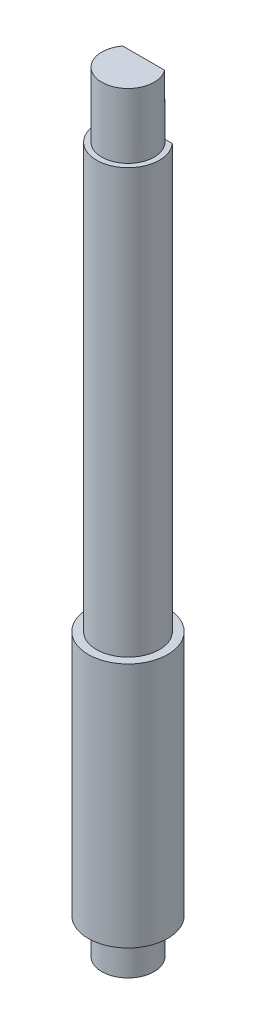
ISO-10303-21;
HEADER;
FILE_DESCRIPTION(('STEP AP214'),'2;1');
FILE_NAME('part.step','',(''),(''),'','','');
FILE_SCHEMA(('AUTOMOTIVE_DESIGN { 1 0 10303 214 1 1 1 1 }'));
ENDSEC;
DATA;
#1=APPLICATION_CONTEXT('core data for automotive mechanical design processes');
#2=APPLICATION_PROTOCOL_DEFINITION('international standard','automotive_design',2000,#1);
#3=PRODUCT_CONTEXT('',#1,'mechanical');
#4=PRODUCT('Part','Part','',(#3));
#5=PRODUCT_RELATED_PRODUCT_CATEGORY('part','',(#4));
#6=PRODUCT_DEFINITION_FORMATION('','',#4);
#7=PRODUCT_DEFINITION_CONTEXT('part definition',#1,'design');
#8=PRODUCT_DEFINITION('design','',#6,#7);
#9=PRODUCT_DEFINITION_SHAPE('','',#8);
#10=(LENGTH_UNIT() NAMED_UNIT(*) SI_UNIT(.MILLI.,.METRE.));
#11=(NAMED_UNIT(*) PLANE_ANGLE_UNIT() SI_UNIT($,.RADIAN.));
#12=(NAMED_UNIT(*) SI_UNIT($,.STERADIAN.) SOLID_ANGLE_UNIT());
#13=UNCERTAINTY_MEASURE_WITH_UNIT(LENGTH_MEASURE(1.E-05),#10,'distance_accuracy_value','');
#14=(GEOMETRIC_REPRESENTATION_CONTEXT(3) GLOBAL_UNCERTAINTY_ASSIGNED_CONTEXT((#13)) GLOBAL_UNIT_ASSIGNED_CONTEXT((#10,
#11,#12)) REPRESENTATION_CONTEXT('',''));
#15=CARTESIAN_POINT('',(0.,0.,0.));
#16=DIRECTION('',(0.,0.,1.));
#17=DIRECTION('',(1.,0.,0.));
#18=AXIS2_PLACEMENT_3D('',#15,#16,#17);
#19=CARTESIAN_POINT('',(-1.11803398874989,-19.6868180292782,-1.));
#20=DIRECTION('',(0.,0.,1.));
#21=DIRECTION('',(1.,0.,0.));
#22=AXIS2_PLACEMENT_3D('',#19,#20,#21);
#23=PLANE('',#22);
#24=DIRECTION('',(-1.,0.,0.));
#25=VECTOR('',#24,1.);
#26=CARTESIAN_POINT('',(-1.1180339887499,4.55446981819967,-1.));
#27=LINE('',#26,#25);
#28=CARTESIAN_POINT('',(0.75,4.55446981819967,-1.));
#29=VERTEX_POINT('',#28);
#30=CARTESIAN_POINT('',(-0.75,4.55446981819967,-1.));
#31=VERTEX_POINT('',#30);
#32=EDGE_CURVE('E11',#29,#31,#27,.T.);
#33=ORIENTED_EDGE('',*,*,#32,.F.);
#34=DIRECTION('',(0.,1.,0.));
#35=VECTOR('',#34,1.);
#36=CARTESIAN_POINT('',(0.75,5.95446981819967,-1.));
#37=LINE('',#36,#35);
#38=CARTESIAN_POINT('',(0.75,2.85446981819967,-1.));
#39=VERTEX_POINT('',#38);
#40=EDGE_CURVE('E57',#29,#39,#37,.F.);
#41=ORIENTED_EDGE('',*,*,#40,.T.);
#42=DIRECTION('',(-1.,0.,0.));
#43=VECTOR('',#42,1.);
#44=CARTESIAN_POINT('',(0.,2.85446981819967,-1.));
#45=LINE('',#44,#43);
#46=CARTESIAN_POINT('',(1.11803398874989,2.85446981819967,-1.));
#47=VERTEX_POINT('',#46);
#48=EDGE_CURVE('E124',#47,#39,#45,.T.);
#49=ORIENTED_EDGE('',*,*,#48,.F.);
#50=DIRECTION('',(0.,1.,0.));
#51=VECTOR('',#50,1.);
#52=CARTESIAN_POINT('',(1.1180339887499,-19.6868180292782,-1.));
#53=LINE('',#52,#51);
#54=CARTESIAN_POINT('',(1.1180339887499,-17.3955301818003,-1.));
#55=VERTEX_POINT('',#54);
#56=EDGE_CURVE('E113',#55,#47,#53,.T.);
#57=ORIENTED_EDGE('',*,*,#56,.F.);
#58=DIRECTION('',(-1.,0.,0.));
#59=VECTOR('',#58,1.);
#60=CARTESIAN_POINT('',(-1.11803398874989,-17.3955301818003,-1.));
#61=LINE('',#60,#59);
#62=CARTESIAN_POINT('',(-1.1180339887499,-17.3955301818003,-1.));
#63=VERTEX_POINT('',#62);
#64=EDGE_CURVE('E116',#55,#63,#61,.T.);
#65=ORIENTED_EDGE('',*,*,#64,.T.);
#66=DIRECTION('',(0.,1.,0.));
#67=VECTOR('',#66,1.);
#68=CARTESIAN_POINT('',(-1.11803398874989,-19.6868180292782,-1.));
#69=LINE('',#68,#67);
#70=CARTESIAN_POINT('',(-1.1180339887499,2.85446981819967,-1.));
#71=VERTEX_POINT('',#70);
#72=EDGE_CURVE('E109',#63,#71,#69,.T.);
#73=ORIENTED_EDGE('',*,*,#72,.T.);
#74=CARTESIAN_POINT('',(-0.75,2.85446981819967,-1.));
#75=VERTEX_POINT('',#74);
#76=EDGE_CURVE('E121',#75,#71,#45,.T.);
#77=ORIENTED_EDGE('',*,*,#76,.F.);
#78=DIRECTION('',(0.,1.,0.));
#79=VECTOR('',#78,1.);
#80=CARTESIAN_POINT('',(-0.75,5.95446981819967,-1.));
#81=LINE('',#80,#79);
#82=EDGE_CURVE('E119',#75,#31,#81,.T.);
#83=ORIENTED_EDGE('',*,*,#82,.T.);
#84=EDGE_LOOP('',(#33,#41,#49,#57,#65,#73,#77,#83));
#85=FACE_BOUND('',#84,.T.);
#86=ADVANCED_FACE('F36',(#85),#23,.F.);
#87=CARTESIAN_POINT('',(0.,5.95446981819967,0.));
#88=DIRECTION('',(0.,1.,0.));
#89=DIRECTION('',(-1.,0.,0.));
#90=AXIS2_PLACEMENT_3D('',#87,#88,#89);
#91=CYLINDRICAL_SURFACE('',#90,1.25);
#92=CARTESIAN_POINT('',(0.,-30.8455301818003,0.));
#93=DIRECTION('',(0.,1.,0.));
#94=DIRECTION('',(-1.,0.,0.));
#95=AXIS2_PLACEMENT_3D('',#92,#93,#94);
#96=CIRCLE('',#95,1.25);
#97=CARTESIAN_POINT('',(-1.25,-30.8455301818003,0.));
#98=VERTEX_POINT('',#97);
#99=EDGE_CURVE('E126',#98,#98,#96,.T.);
#100=ORIENTED_EDGE('',*,*,#99,.T.);
#101=EDGE_LOOP('',(#100));
#102=FACE_BOUND('',#101,.T.);
#103=CARTESIAN_POINT('',(0.,-29.1455301818003,0.));
#104=DIRECTION('',(0.,1.,0.));
#105=DIRECTION('',(-1.,0.,0.));
#106=AXIS2_PLACEMENT_3D('',#103,#104,#105);
#107=CIRCLE('',#106,1.25);
#108=CARTESIAN_POINT('',(-1.25,-29.1455301818003,0.));
#109=VERTEX_POINT('',#108);
#110=EDGE_CURVE('E44',#109,#109,#107,.T.);
#111=ORIENTED_EDGE('',*,*,#110,.F.);
#112=EDGE_LOOP('',(#111));
#113=FACE_BOUND('',#112,.T.);
#114=ADVANCED_FACE('F38',(#102,#113),#91,.T.);
#115=CARTESIAN_POINT('',(0.,-29.1455301818003,0.));
#116=DIRECTION('',(0.,-1.,0.));
#117=DIRECTION('',(1.,0.,0.));
#118=AXIS2_PLACEMENT_3D('',#115,#116,#117);
#119=PLANE('',#118);
#120=ORIENTED_EDGE('',*,*,#110,.T.);
#121=EDGE_LOOP('',(#120));
#122=FACE_BOUND('',#121,.T.);
#123=CARTESIAN_POINT('',(0.,-29.1455301818003,0.));
#124=DIRECTION('',(0.,1.,0.));
#125=DIRECTION('',(-1.,0.,0.));
#126=AXIS2_PLACEMENT_3D('',#123,#124,#125);
#127=CIRCLE('',#126,1.9);
#128=CARTESIAN_POINT('',(-1.9,-29.1455301818003,0.));
#129=VERTEX_POINT('',#128);
#130=EDGE_CURVE('E142',#129,#129,#127,.T.);
#131=ORIENTED_EDGE('',*,*,#130,.F.);
#132=EDGE_LOOP('',(#131));
#133=FACE_BOUND('',#132,.T.);
#134=ADVANCED_FACE('F147',(#122,#133),#119,.T.);
#135=CARTESIAN_POINT('',(0.,5.95446981819967,0.));
#136=DIRECTION('',(0.,1.,0.));
#137=DIRECTION('',(-1.,0.,0.));
#138=AXIS2_PLACEMENT_3D('',#135,#136,#137);
#139=CYLINDRICAL_SURFACE('',#138,1.9);
#140=ORIENTED_EDGE('',*,*,#130,.T.);
#141=EDGE_LOOP('',(#140));
#142=FACE_BOUND('',#141,.T.);
#143=CARTESIAN_POINT('',(0.,-17.3955301818003,0.));
#144=DIRECTION('',(0.,1.,0.));
#145=DIRECTION('',(-1.,0.,0.));
#146=AXIS2_PLACEMENT_3D('',#143,#144,#145);
#147=CIRCLE('',#146,1.9);
#148=CARTESIAN_POINT('',(-1.9,-17.3955301818003,0.));
#149=VERTEX_POINT('',#148);
#150=EDGE_CURVE('E139',#149,#149,#147,.T.);
#151=ORIENTED_EDGE('',*,*,#150,.F.);
#152=EDGE_LOOP('',(#151));
#153=FACE_BOUND('',#152,.T.);
#154=ADVANCED_FACE('F156',(#142,#153),#139,.T.);
#155=CARTESIAN_POINT('',(0.,-17.3955301818003,0.));
#156=DIRECTION('',(0.,1.,0.));
#157=DIRECTION('',(-1.,0.,0.));
#158=AXIS2_PLACEMENT_3D('',#155,#156,#157);
#159=PLANE('',#158);
#160=ORIENTED_EDGE('',*,*,#150,.T.);
#161=EDGE_LOOP('',(#160));
#162=FACE_BOUND('',#161,.T.);
#163=CARTESIAN_POINT('',(0.,-17.3955301818003,0.));
#164=DIRECTION('',(0.,1.,0.));
#165=DIRECTION('',(-1.,0.,0.));
#166=AXIS2_PLACEMENT_3D('',#163,#164,#165);
#167=CIRCLE('',#166,1.5);
#168=EDGE_CURVE('E136',#63,#55,#167,.T.);
#169=ORIENTED_EDGE('',*,*,#168,.F.);
#170=ORIENTED_EDGE('',*,*,#64,.F.);
#171=EDGE_LOOP('',(#169,#170));
#172=FACE_BOUND('',#171,.T.);
#173=ADVANCED_FACE('F182',(#162,#172),#159,.T.);
#174=CARTESIAN_POINT('',(0.,5.95446981819967,0.));
#175=DIRECTION('',(0.,1.,0.));
#176=DIRECTION('',(-1.,0.,0.));
#177=AXIS2_PLACEMENT_3D('',#174,#175,#176);
#178=CYLINDRICAL_SURFACE('',#177,1.5);
#179=ORIENTED_EDGE('',*,*,#56,.T.);
#180=CARTESIAN_POINT('',(0.,2.85446981819967,0.));
#181=DIRECTION('',(0.,1.,0.));
#182=DIRECTION('',(-1.,0.,0.));
#183=AXIS2_PLACEMENT_3D('',#180,#181,#182);
#184=CIRCLE('',#183,1.5);
#185=EDGE_CURVE('E133',#71,#47,#184,.T.);
#186=ORIENTED_EDGE('',*,*,#185,.F.);
#187=ORIENTED_EDGE('',*,*,#72,.F.);
#188=ORIENTED_EDGE('',*,*,#168,.T.);
#189=EDGE_LOOP('',(#179,#186,#187,#188));
#190=FACE_BOUND('',#189,.T.);
#191=ADVANCED_FACE('F178',(#190),#178,.T.);
#192=CARTESIAN_POINT('',(0.,2.85446981819967,0.));
#193=DIRECTION('',(0.,-1.,0.));
#194=DIRECTION('',(1.,0.,0.));
#195=AXIS2_PLACEMENT_3D('',#192,#193,#194);
#196=PLANE('',#195);
#197=ORIENTED_EDGE('',*,*,#185,.T.);
#198=ORIENTED_EDGE('',*,*,#48,.T.);
#199=CARTESIAN_POINT('',(0.,2.85446981819967,0.));
#200=DIRECTION('',(0.,1.,0.));
#201=DIRECTION('',(-1.,0.,0.));
#202=AXIS2_PLACEMENT_3D('',#199,#200,#201);
#203=CIRCLE('',#202,1.25);
#204=EDGE_CURVE('E130',#75,#39,#203,.T.);
#205=ORIENTED_EDGE('',*,*,#204,.F.);
#206=ORIENTED_EDGE('',*,*,#76,.T.);
#207=EDGE_LOOP('',(#197,#198,#205,#206));
#208=FACE_BOUND('',#207,.T.);
#209=ADVANCED_FACE('F175',(#208),#196,.F.);
#210=CARTESIAN_POINT('',(0.,5.95446981819967,0.));
#211=DIRECTION('',(0.,1.,0.));
#212=DIRECTION('',(-1.,0.,0.));
#213=AXIS2_PLACEMENT_3D('',#210,#211,#212);
#214=CYLINDRICAL_SURFACE('',#213,1.25);
#215=DIRECTION('',(0.,1.,0.));
#216=VECTOR('',#215,1.);
#217=CARTESIAN_POINT('',(-1.,4.55446981819967,-0.75));
#218=LINE('',#217,#216);
#219=CARTESIAN_POINT('',(-1.,4.55446981819967,-0.75));
#220=VERTEX_POINT('',#219);
#221=CARTESIAN_POINT('',(-1.,5.95446981819967,-0.75));
#222=VERTEX_POINT('',#221);
#223=EDGE_CURVE('E99',#220,#222,#218,.T.);
#224=ORIENTED_EDGE('',*,*,#223,.F.);
#225=CARTESIAN_POINT('',(0.,4.55446981819967,0.));
#226=DIRECTION('',(0.,1.,0.));
#227=DIRECTION('',(-1.,0.,0.));
#228=AXIS2_PLACEMENT_3D('',#225,#226,#227);
#229=CIRCLE('',#228,1.25);
#230=EDGE_CURVE('E87',#31,#220,#229,.T.);
#231=ORIENTED_EDGE('',*,*,#230,.F.);
#232=ORIENTED_EDGE('',*,*,#82,.F.);
#233=ORIENTED_EDGE('',*,*,#204,.T.);
#234=ORIENTED_EDGE('',*,*,#40,.F.);
#235=CARTESIAN_POINT('',(1.,4.55446981819967,-0.75));
#236=VERTEX_POINT('',#235);
#237=EDGE_CURVE('E50',#236,#29,#229,.T.);
#238=ORIENTED_EDGE('',*,*,#237,.F.);
#239=DIRECTION('',(0.,1.,0.));
#240=VECTOR('',#239,1.);
#241=CARTESIAN_POINT('',(1.,4.55446981819967,-0.75));
#242=LINE('',#241,#240);
#243=CARTESIAN_POINT('',(1.,5.95446981819967,-0.75));
#244=VERTEX_POINT('',#243);
#245=EDGE_CURVE('E102',#236,#244,#242,.T.);
#246=ORIENTED_EDGE('',*,*,#245,.T.);
#247=CARTESIAN_POINT('',(0.,5.95446981819967,0.));
#248=DIRECTION('',(0.,1.,0.));
#249=DIRECTION('',(-1.,0.,0.));
#250=AXIS2_PLACEMENT_3D('',#247,#248,#249);
#251=CIRCLE('',#250,1.25);
#252=EDGE_CURVE('E107',#222,#244,#251,.T.);
#253=ORIENTED_EDGE('',*,*,#252,.F.);
#254=EDGE_LOOP('',(#224,#231,#232,#233,#234,#238,#246,#253));
#255=FACE_BOUND('',#254,.T.);
#256=ADVANCED_FACE('F105',(#255),#214,.T.);
#257=CARTESIAN_POINT('',(0.,5.95446981819967,0.));
#258=DIRECTION('',(0.,-1.,0.));
#259=DIRECTION('',(1.,0.,0.));
#260=AXIS2_PLACEMENT_3D('',#257,#258,#259);
#261=PLANE('',#260);
#262=ORIENTED_EDGE('',*,*,#252,.T.);
#263=DIRECTION('',(1.,0.,0.));
#264=VECTOR('',#263,1.);
#265=CARTESIAN_POINT('',(-1.,5.95446981819967,-0.75));
#266=LINE('',#265,#264);
#267=EDGE_CURVE('E95',#222,#244,#266,.T.);
#268=ORIENTED_EDGE('',*,*,#267,.F.);
#269=EDGE_LOOP('',(#262,#268));
#270=FACE_BOUND('',#269,.T.);
#271=ADVANCED_FACE('F162',(#270),#261,.F.);
#272=CARTESIAN_POINT('',(0.,-30.8455301818003,0.));
#273=DIRECTION('',(0.,-1.,0.));
#274=DIRECTION('',(1.,0.,0.));
#275=AXIS2_PLACEMENT_3D('',#272,#273,#274);
#276=PLANE('',#275);
#277=ORIENTED_EDGE('',*,*,#99,.F.);
#278=EDGE_LOOP('',(#277));
#279=FACE_BOUND('',#278,.T.);
#280=ADVANCED_FACE('F160',(#279),#276,.T.);
#281=CARTESIAN_POINT('',(0.,4.55446981819967,0.));
#282=DIRECTION('',(0.,1.,0.));
#283=DIRECTION('',(-1.,0.,0.));
#284=AXIS2_PLACEMENT_3D('',#281,#282,#283);
#285=PLANE('',#284);
#286=ORIENTED_EDGE('',*,*,#32,.T.);
#287=ORIENTED_EDGE('',*,*,#230,.T.);
#288=DIRECTION('',(1.,0.,0.));
#289=VECTOR('',#288,1.);
#290=CARTESIAN_POINT('',(-1.,4.55446981819967,-0.75));
#291=LINE('',#290,#289);
#292=EDGE_CURVE('E90',#220,#236,#291,.T.);
#293=ORIENTED_EDGE('',*,*,#292,.T.);
#294=ORIENTED_EDGE('',*,*,#237,.T.);
#295=EDGE_LOOP('',(#286,#287,#293,#294));
#296=FACE_BOUND('',#295,.T.);
#297=ADVANCED_FACE('F89',(#296),#285,.T.);
#298=CARTESIAN_POINT('',(-1.,4.55446981819967,-0.75));
#299=DIRECTION('',(0.,0.,1.));
#300=DIRECTION('',(1.,0.,0.));
#301=AXIS2_PLACEMENT_3D('',#298,#299,#300);
#302=PLANE('',#301);
#303=ORIENTED_EDGE('',*,*,#267,.T.);
#304=ORIENTED_EDGE('',*,*,#245,.F.);
#305=ORIENTED_EDGE('',*,*,#292,.F.);
#306=ORIENTED_EDGE('',*,*,#223,.T.);
#307=EDGE_LOOP('',(#303,#304,#305,#306));
#308=FACE_BOUND('',#307,.T.);
#309=ADVANCED_FACE('F98',(#308),#302,.F.);
#310=CLOSED_SHELL('',(#86,#114,#134,#154,#173,#191,#209,#256,#271,#280,#297,#309));
#311=MANIFOLD_SOLID_BREP('B2',#310);
#312=ADVANCED_BREP_SHAPE_REPRESENTATION('',(#18,#311),#14);
#313=SHAPE_DEFINITION_REPRESENTATION(#9,#312);
ENDSEC;
END-ISO-10303-21;
